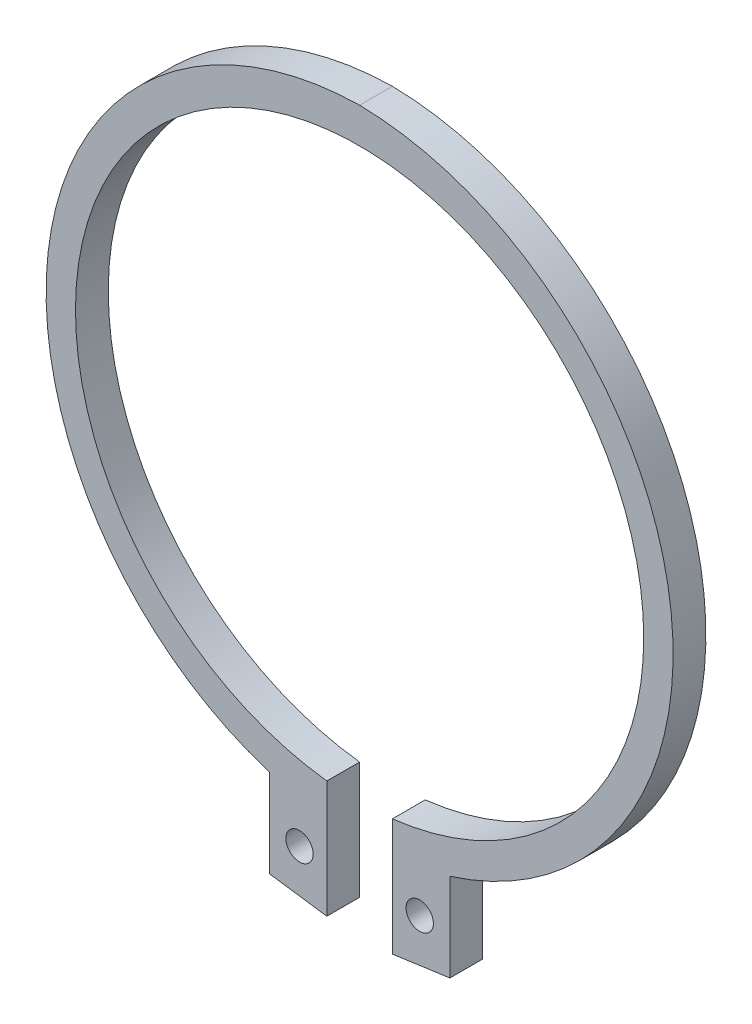
ISO-10303-21;
HEADER;
FILE_DESCRIPTION(('STEP AP214'),'2;1');
FILE_NAME('part.step','',(''),(''),'','','');
FILE_SCHEMA(('AUTOMOTIVE_DESIGN { 1 0 10303 214 1 1 1 1 }'));
ENDSEC;
DATA;
#1=APPLICATION_CONTEXT('core data for automotive mechanical design processes');
#2=APPLICATION_PROTOCOL_DEFINITION('international standard','automotive_design',2000,#1);
#3=PRODUCT_CONTEXT('',#1,'mechanical');
#4=PRODUCT('Part','Part','',(#3));
#5=PRODUCT_RELATED_PRODUCT_CATEGORY('part','',(#4));
#6=PRODUCT_DEFINITION_FORMATION('','',#4);
#7=PRODUCT_DEFINITION_CONTEXT('part definition',#1,'design');
#8=PRODUCT_DEFINITION('design','',#6,#7);
#9=PRODUCT_DEFINITION_SHAPE('','',#8);
#10=(LENGTH_UNIT() NAMED_UNIT(*) SI_UNIT(.MILLI.,.METRE.));
#11=(NAMED_UNIT(*) PLANE_ANGLE_UNIT() SI_UNIT($,.RADIAN.));
#12=(NAMED_UNIT(*) SI_UNIT($,.STERADIAN.) SOLID_ANGLE_UNIT());
#13=UNCERTAINTY_MEASURE_WITH_UNIT(LENGTH_MEASURE(1.E-05),#10,'distance_accuracy_value','');
#14=(GEOMETRIC_REPRESENTATION_CONTEXT(3) GLOBAL_UNCERTAINTY_ASSIGNED_CONTEXT((#13)) GLOBAL_UNIT_ASSIGNED_CONTEXT((#10,
#11,#12)) REPRESENTATION_CONTEXT('',''));
#15=CARTESIAN_POINT('',(0.,0.,0.));
#16=DIRECTION('',(0.,0.,1.));
#17=DIRECTION('',(1.,0.,0.));
#18=AXIS2_PLACEMENT_3D('',#15,#16,#17);
#19=CARTESIAN_POINT('',(5.5,-32.25,1.5));
#20=DIRECTION('',(0.,0.,-1.));
#21=DIRECTION('',(1.,0.,0.));
#22=AXIS2_PLACEMENT_3D('',#19,#20,#21);
#23=CYLINDRICAL_SURFACE('',#22,1.25);
#24=CARTESIAN_POINT('',(5.5,-32.25,0.));
#25=DIRECTION('',(0.,0.,1.));
#26=DIRECTION('',(1.,0.,0.));
#27=AXIS2_PLACEMENT_3D('',#24,#25,#26);
#28=CIRCLE('',#27,1.25);
#29=CARTESIAN_POINT('',(6.75,-32.25,0.));
#30=VERTEX_POINT('',#29);
#31=EDGE_CURVE('E32',#30,#30,#28,.T.);
#32=ORIENTED_EDGE('',*,*,#31,.F.);
#33=EDGE_LOOP('',(#32));
#34=FACE_BOUND('',#33,.T.);
#35=CARTESIAN_POINT('',(5.5,-32.25,3.));
#36=DIRECTION('',(0.,0.,-1.));
#37=DIRECTION('',(1.,0.,0.));
#38=AXIS2_PLACEMENT_3D('',#35,#36,#37);
#39=CIRCLE('',#38,1.25);
#40=CARTESIAN_POINT('',(6.75,-32.25,3.));
#41=VERTEX_POINT('',#40);
#42=EDGE_CURVE('E102',#41,#41,#39,.T.);
#43=ORIENTED_EDGE('',*,*,#42,.F.);
#44=EDGE_LOOP('',(#43));
#45=FACE_BOUND('',#44,.T.);
#46=ADVANCED_FACE('F16',(#34,#45),#23,.F.);
#47=CARTESIAN_POINT('',(-5.5,-32.25,1.5));
#48=DIRECTION('',(0.,0.,-1.));
#49=DIRECTION('',(1.,0.,0.));
#50=AXIS2_PLACEMENT_3D('',#47,#48,#49);
#51=CYLINDRICAL_SURFACE('',#50,1.25);
#52=CARTESIAN_POINT('',(-5.5,-32.25,0.));
#53=DIRECTION('',(0.,0.,1.));
#54=DIRECTION('',(1.,0.,0.));
#55=AXIS2_PLACEMENT_3D('',#52,#53,#54);
#56=CIRCLE('',#55,1.25);
#57=CARTESIAN_POINT('',(-4.25,-32.25,0.));
#58=VERTEX_POINT('',#57);
#59=EDGE_CURVE('E116',#58,#58,#56,.T.);
#60=ORIENTED_EDGE('',*,*,#59,.F.);
#61=EDGE_LOOP('',(#60));
#62=FACE_BOUND('',#61,.T.);
#63=CARTESIAN_POINT('',(-5.5,-32.25,3.));
#64=DIRECTION('',(0.,0.,-1.));
#65=DIRECTION('',(1.,0.,0.));
#66=AXIS2_PLACEMENT_3D('',#63,#64,#65);
#67=CIRCLE('',#66,1.25);
#68=CARTESIAN_POINT('',(-4.25,-32.25,3.));
#69=VERTEX_POINT('',#68);
#70=EDGE_CURVE('E113',#69,#69,#67,.T.);
#71=ORIENTED_EDGE('',*,*,#70,.F.);
#72=EDGE_LOOP('',(#71));
#73=FACE_BOUND('',#72,.T.);
#74=ADVANCED_FACE('F176',(#62,#73),#51,.F.);
#75=CARTESIAN_POINT('',(3.,-21.375,1.5));
#76=DIRECTION('',(-1.,0.,0.));
#77=DIRECTION('',(0.,0.,1.));
#78=AXIS2_PLACEMENT_3D('',#75,#76,#77);
#79=PLANE('',#78);
#80=DIRECTION('',(0.,0.,-1.));
#81=VECTOR('',#80,1.);
#82=CARTESIAN_POINT('',(3.,-36.5479621922823,2.25));
#83=LINE('',#82,#81);
#84=CARTESIAN_POINT('',(3.,-36.5479621922823,3.));
#85=VERTEX_POINT('',#84);
#86=CARTESIAN_POINT('',(3.,-36.5479621922823,0.));
#87=VERTEX_POINT('',#86);
#88=EDGE_CURVE('E11',#85,#87,#83,.T.);
#89=ORIENTED_EDGE('',*,*,#88,.F.);
#90=DIRECTION('',(0.,-1.,0.));
#91=VECTOR('',#90,1.);
#92=CARTESIAN_POINT('',(3.,-11.8490318690869,3.));
#93=LINE('',#92,#91);
#94=CARTESIAN_POINT('',(3.,-25.8263431402899,3.));
#95=VERTEX_POINT('',#94);
#96=EDGE_CURVE('E110',#95,#85,#93,.T.);
#97=ORIENTED_EDGE('',*,*,#96,.F.);
#98=DIRECTION('',(0.,0.,1.));
#99=VECTOR('',#98,1.);
#100=CARTESIAN_POINT('',(3.,-25.8263431402899,1.5));
#101=LINE('',#100,#99);
#102=CARTESIAN_POINT('',(3.,-25.8263431402899,0.));
#103=VERTEX_POINT('',#102);
#104=EDGE_CURVE('E119',#103,#95,#101,.T.);
#105=ORIENTED_EDGE('',*,*,#104,.F.);
#106=DIRECTION('',(0.,1.,0.));
#107=VECTOR('',#106,1.);
#108=CARTESIAN_POINT('',(3.,-11.8490318690869,0.));
#109=LINE('',#108,#107);
#110=EDGE_CURVE('E79',#87,#103,#109,.T.);
#111=ORIENTED_EDGE('',*,*,#110,.F.);
#112=EDGE_LOOP('',(#89,#97,#105,#111));
#113=FACE_BOUND('',#112,.T.);
#114=ADVANCED_FACE('F208',(#113),#79,.T.);
#115=CARTESIAN_POINT('',(-3.,-21.375,1.5));
#116=DIRECTION('',(1.,0.,0.));
#117=DIRECTION('',(0.,0.,-1.));
#118=AXIS2_PLACEMENT_3D('',#115,#116,#117);
#119=PLANE('',#118);
#120=DIRECTION('',(0.,0.,1.));
#121=VECTOR('',#120,1.);
#122=CARTESIAN_POINT('',(-3.,-36.5479621922823,0.75));
#123=LINE('',#122,#121);
#124=CARTESIAN_POINT('',(-3.,-36.5479621922823,0.));
#125=VERTEX_POINT('',#124);
#126=CARTESIAN_POINT('',(-3.,-36.5479621922823,3.));
#127=VERTEX_POINT('',#126);
#128=EDGE_CURVE('E55',#125,#127,#123,.T.);
#129=ORIENTED_EDGE('',*,*,#128,.F.);
#130=DIRECTION('',(0.,-1.,0.));
#131=VECTOR('',#130,1.);
#132=CARTESIAN_POINT('',(-3.,-11.8490318690869,0.));
#133=LINE('',#132,#131);
#134=CARTESIAN_POINT('',(-3.,-25.8263431402899,0.));
#135=VERTEX_POINT('',#134);
#136=EDGE_CURVE('E59',#135,#125,#133,.T.);
#137=ORIENTED_EDGE('',*,*,#136,.F.);
#138=DIRECTION('',(0.,0.,-1.));
#139=VECTOR('',#138,1.);
#140=CARTESIAN_POINT('',(-3.,-25.8263431402899,1.5));
#141=LINE('',#140,#139);
#142=CARTESIAN_POINT('',(-3.,-25.8263431402899,3.));
#143=VERTEX_POINT('',#142);
#144=EDGE_CURVE('E109',#143,#135,#141,.T.);
#145=ORIENTED_EDGE('',*,*,#144,.F.);
#146=DIRECTION('',(0.,1.,0.));
#147=VECTOR('',#146,1.);
#148=CARTESIAN_POINT('',(-3.,-11.8490318690869,3.));
#149=LINE('',#148,#147);
#150=EDGE_CURVE('E63',#127,#143,#149,.T.);
#151=ORIENTED_EDGE('',*,*,#150,.F.);
#152=EDGE_LOOP('',(#129,#137,#145,#151));
#153=FACE_BOUND('',#152,.T.);
#154=ADVANCED_FACE('F57',(#153),#119,.T.);
#155=CARTESIAN_POINT('',(5.26650027928807,-36.2295810156214,3.));
#156=DIRECTION('',(0.139106833678077,-0.990277379739667,0.));
#157=DIRECTION('',(-0.990277379739667,-0.139106833678077,0.));
#158=AXIS2_PLACEMENT_3D('',#155,#156,#157);
#159=PLANE('',#158);
#160=ORIENTED_EDGE('',*,*,#88,.T.);
#161=DIRECTION('',(0.990277379739667,0.139106833678077,0.));
#162=VECTOR('',#161,1.);
#163=CARTESIAN_POINT('',(8.26695124713703,-35.8080998808574,0.));
#164=LINE('',#163,#162);
#165=CARTESIAN_POINT('',(8.26695124713703,-35.8080998808574,0.));
#166=VERTEX_POINT('',#165);
#167=EDGE_CURVE('E20',#87,#166,#164,.T.);
#168=ORIENTED_EDGE('',*,*,#167,.T.);
#169=DIRECTION('',(0.,0.,-1.));
#170=VECTOR('',#169,1.);
#171=CARTESIAN_POINT('',(8.26695124713703,-35.8080998808574,3.));
#172=LINE('',#171,#170);
#173=CARTESIAN_POINT('',(8.26695124713703,-35.8080998808574,3.));
#174=VERTEX_POINT('',#173);
#175=EDGE_CURVE('E95',#174,#166,#172,.T.);
#176=ORIENTED_EDGE('',*,*,#175,.F.);
#177=DIRECTION('',(-0.990277379739667,-0.139106833678077,0.));
#178=VECTOR('',#177,1.);
#179=CARTESIAN_POINT('',(8.26695124713703,-35.8080998808574,3.));
#180=LINE('',#179,#178);
#181=EDGE_CURVE('E115',#174,#85,#180,.T.);
#182=ORIENTED_EDGE('',*,*,#181,.T.);
#183=EDGE_LOOP('',(#160,#168,#176,#182));
#184=FACE_BOUND('',#183,.T.);
#185=ADVANCED_FACE('F205',(#184),#159,.T.);
#186=CARTESIAN_POINT('',(-14.9876790173679,-2.32306373817371,0.));
#187=DIRECTION('',(0.,0.,1.));
#188=DIRECTION('',(1.,0.,0.));
#189=AXIS2_PLACEMENT_3D('',#186,#187,#188);
#190=PLANE('',#189);
#191=ORIENTED_EDGE('',*,*,#31,.T.);
#192=EDGE_LOOP('',(#191));
#193=FACE_BOUND('',#192,.T.);
#194=ORIENTED_EDGE('',*,*,#59,.T.);
#195=EDGE_LOOP('',(#194));
#196=FACE_BOUND('',#195,.T.);
#197=ORIENTED_EDGE('',*,*,#110,.T.);
#198=CARTESIAN_POINT('',(0.,0.,0.));
#199=DIRECTION('',(0.,0.,-1.));
#200=DIRECTION('',(-1.,0.,0.));
#201=AXIS2_PLACEMENT_3D('',#198,#199,#200);
#202=CIRCLE('',#201,26.);
#203=EDGE_CURVE('E68',#135,#103,#202,.T.);
#204=ORIENTED_EDGE('',*,*,#203,.F.);
#205=ORIENTED_EDGE('',*,*,#136,.T.);
#206=DIRECTION('',(0.990277379739667,-0.139106833678077,0.));
#207=VECTOR('',#206,1.);
#208=CARTESIAN_POINT('',(-8.26695124713703,-35.8080998808574,0.));
#209=LINE('',#208,#207);
#210=CARTESIAN_POINT('',(-8.26695124713703,-35.8080998808574,0.));
#211=VERTEX_POINT('',#210);
#212=EDGE_CURVE('E76',#211,#125,#209,.T.);
#213=ORIENTED_EDGE('',*,*,#212,.F.);
#214=DIRECTION('',(0.,1.,0.));
#215=VECTOR('',#214,1.);
#216=CARTESIAN_POINT('',(-8.26695124713703,-35.8080998808574,0.));
#217=LINE('',#216,#215);
#218=CARTESIAN_POINT('',(-8.26695124713703,-27.7455998808574,0.));
#219=VERTEX_POINT('',#218);
#220=EDGE_CURVE('E80',#211,#219,#217,.T.);
#221=ORIENTED_EDGE('',*,*,#220,.T.);
#222=CARTESIAN_POINT('',(0.469411108907729,0.0717794076376238,0.));
#223=DIRECTION('',(0.,0.,1.));
#224=DIRECTION('',(1.,0.,0.));
#225=AXIS2_PLACEMENT_3D('',#222,#223,#224);
#226=CIRCLE('',#225,29.156999463184);
#227=CARTESIAN_POINT('',(0.,29.225,0.));
#228=VERTEX_POINT('',#227);
#229=EDGE_CURVE('E96',#228,#219,#226,.T.);
#230=ORIENTED_EDGE('',*,*,#229,.F.);
#231=CARTESIAN_POINT('',(-0.469411108907728,0.0717794076376238,0.));
#232=DIRECTION('',(0.,0.,1.));
#233=DIRECTION('',(-1.,0.,0.));
#234=AXIS2_PLACEMENT_3D('',#231,#232,#233);
#235=CIRCLE('',#234,29.156999463184);
#236=CARTESIAN_POINT('',(8.26695124713703,-27.7455998808574,0.));
#237=VERTEX_POINT('',#236);
#238=EDGE_CURVE('E125',#237,#228,#235,.T.);
#239=ORIENTED_EDGE('',*,*,#238,.F.);
#240=DIRECTION('',(0.,1.,0.));
#241=VECTOR('',#240,1.);
#242=CARTESIAN_POINT('',(8.26695124713703,-35.8080998808574,0.));
#243=LINE('',#242,#241);
#244=EDGE_CURVE('E107',#166,#237,#243,.T.);
#245=ORIENTED_EDGE('',*,*,#244,.F.);
#246=ORIENTED_EDGE('',*,*,#167,.F.);
#247=EDGE_LOOP('',(#197,#204,#205,#213,#221,#230,#239,#245,#246));
#248=FACE_BOUND('',#247,.T.);
#249=ADVANCED_FACE('F74',(#193,#196,#248),#190,.F.);
#250=CARTESIAN_POINT('',(-0.469411108907729,0.0717794076376238,3.));
#251=DIRECTION('',(0.,0.,1.));
#252=DIRECTION('',(-1.,0.,0.));
#253=AXIS2_PLACEMENT_3D('',#250,#251,#252);
#254=CYLINDRICAL_SURFACE('',#253,29.156999463184);
#255=ORIENTED_EDGE('',*,*,#238,.T.);
#256=DIRECTION('',(0.,0.,1.));
#257=VECTOR('',#256,1.);
#258=CARTESIAN_POINT('',(0.,29.225,0.));
#259=LINE('',#258,#257);
#260=CARTESIAN_POINT('',(0.,29.225,3.));
#261=VERTEX_POINT('',#260);
#262=EDGE_CURVE('E122',#228,#261,#259,.T.);
#263=ORIENTED_EDGE('',*,*,#262,.T.);
#264=CARTESIAN_POINT('',(-0.469411108907729,0.0717794076376238,3.));
#265=DIRECTION('',(0.,0.,-1.));
#266=DIRECTION('',(-1.,0.,0.));
#267=AXIS2_PLACEMENT_3D('',#264,#265,#266);
#268=CIRCLE('',#267,29.156999463184);
#269=CARTESIAN_POINT('',(8.26695124713703,-27.7455998808574,3.));
#270=VERTEX_POINT('',#269);
#271=EDGE_CURVE('E106',#261,#270,#268,.T.);
#272=ORIENTED_EDGE('',*,*,#271,.T.);
#273=DIRECTION('',(0.,0.,-1.));
#274=VECTOR('',#273,1.);
#275=CARTESIAN_POINT('',(8.26695124713703,-27.7455998808574,3.));
#276=LINE('',#275,#274);
#277=EDGE_CURVE('E103',#270,#237,#276,.T.);
#278=ORIENTED_EDGE('',*,*,#277,.T.);
#279=EDGE_LOOP('',(#255,#263,#272,#278));
#280=FACE_BOUND('',#279,.T.);
#281=ADVANCED_FACE('F202',(#280),#254,.T.);
#282=CARTESIAN_POINT('',(8.26695124713703,-31.7768498808574,3.));
#283=DIRECTION('',(1.,0.,0.));
#284=DIRECTION('',(0.,-1.,0.));
#285=AXIS2_PLACEMENT_3D('',#282,#283,#284);
#286=PLANE('',#285);
#287=ORIENTED_EDGE('',*,*,#244,.T.);
#288=ORIENTED_EDGE('',*,*,#277,.F.);
#289=DIRECTION('',(0.,1.,0.));
#290=VECTOR('',#289,1.);
#291=CARTESIAN_POINT('',(8.26695124713703,-35.8080998808574,3.));
#292=LINE('',#291,#290);
#293=EDGE_CURVE('E99',#174,#270,#292,.T.);
#294=ORIENTED_EDGE('',*,*,#293,.F.);
#295=ORIENTED_EDGE('',*,*,#175,.T.);
#296=EDGE_LOOP('',(#287,#288,#294,#295));
#297=FACE_BOUND('',#296,.T.);
#298=ADVANCED_FACE('F197',(#297),#286,.T.);
#299=CARTESIAN_POINT('',(0.469411108907729,0.0717794076376238,0.));
#300=DIRECTION('',(0.,0.,-1.));
#301=DIRECTION('',(1.,0.,0.));
#302=AXIS2_PLACEMENT_3D('',#299,#300,#301);
#303=CYLINDRICAL_SURFACE('',#302,29.156999463184);
#304=CARTESIAN_POINT('',(0.469411108907729,0.0717794076376238,3.));
#305=DIRECTION('',(0.,0.,-1.));
#306=DIRECTION('',(1.,0.,0.));
#307=AXIS2_PLACEMENT_3D('',#304,#305,#306);
#308=CIRCLE('',#307,29.156999463184);
#309=CARTESIAN_POINT('',(-8.26695124713703,-27.7455998808574,3.));
#310=VERTEX_POINT('',#309);
#311=EDGE_CURVE('E93',#310,#261,#308,.T.);
#312=ORIENTED_EDGE('',*,*,#311,.T.);
#313=ORIENTED_EDGE('',*,*,#262,.F.);
#314=ORIENTED_EDGE('',*,*,#229,.T.);
#315=DIRECTION('',(0.,0.,1.));
#316=VECTOR('',#315,1.);
#317=CARTESIAN_POINT('',(-8.26695124713703,-27.7455998808574,0.));
#318=LINE('',#317,#316);
#319=EDGE_CURVE('E118',#219,#310,#318,.T.);
#320=ORIENTED_EDGE('',*,*,#319,.T.);
#321=EDGE_LOOP('',(#312,#313,#314,#320));
#322=FACE_BOUND('',#321,.T.);
#323=ADVANCED_FACE('F133',(#322),#303,.T.);
#324=CARTESIAN_POINT('',(0.,0.,0.));
#325=DIRECTION('',(0.,0.,-1.));
#326=DIRECTION('',(1.,0.,0.));
#327=AXIS2_PLACEMENT_3D('',#324,#325,#326);
#328=CYLINDRICAL_SURFACE('',#327,26.);
#329=ORIENTED_EDGE('',*,*,#104,.T.);
#330=CARTESIAN_POINT('',(0.,0.,3.));
#331=DIRECTION('',(0.,0.,-1.));
#332=DIRECTION('',(-1.,0.,0.));
#333=AXIS2_PLACEMENT_3D('',#330,#331,#332);
#334=CIRCLE('',#333,26.);
#335=EDGE_CURVE('E100',#143,#95,#334,.T.);
#336=ORIENTED_EDGE('',*,*,#335,.F.);
#337=ORIENTED_EDGE('',*,*,#144,.T.);
#338=ORIENTED_EDGE('',*,*,#203,.T.);
#339=EDGE_LOOP('',(#329,#336,#337,#338));
#340=FACE_BOUND('',#339,.T.);
#341=ADVANCED_FACE('F212',(#340),#328,.F.);
#342=CARTESIAN_POINT('',(-5.26650027928807,-36.2295810156214,0.));
#343=DIRECTION('',(-0.139106833678077,-0.990277379739667,0.));
#344=DIRECTION('',(0.990277379739667,-0.139106833678077,0.));
#345=AXIS2_PLACEMENT_3D('',#342,#343,#344);
#346=PLANE('',#345);
#347=ORIENTED_EDGE('',*,*,#128,.T.);
#348=DIRECTION('',(-0.990277379739667,0.139106833678077,0.));
#349=VECTOR('',#348,1.);
#350=CARTESIAN_POINT('',(-8.26695124713703,-35.8080998808574,3.));
#351=LINE('',#350,#349);
#352=CARTESIAN_POINT('',(-8.26695124713703,-35.8080998808574,3.));
#353=VERTEX_POINT('',#352);
#354=EDGE_CURVE('E69',#127,#353,#351,.T.);
#355=ORIENTED_EDGE('',*,*,#354,.T.);
#356=DIRECTION('',(0.,0.,1.));
#357=VECTOR('',#356,1.);
#358=CARTESIAN_POINT('',(-8.26695124713703,-35.8080998808574,0.));
#359=LINE('',#358,#357);
#360=EDGE_CURVE('E85',#211,#353,#359,.T.);
#361=ORIENTED_EDGE('',*,*,#360,.F.);
#362=ORIENTED_EDGE('',*,*,#212,.T.);
#363=EDGE_LOOP('',(#347,#355,#361,#362));
#364=FACE_BOUND('',#363,.T.);
#365=ADVANCED_FACE('F83',(#364),#346,.T.);
#366=CARTESIAN_POINT('',(-8.26695124713703,-31.7768498808574,0.));
#367=DIRECTION('',(-1.,0.,0.));
#368=DIRECTION('',(0.,-1.,0.));
#369=AXIS2_PLACEMENT_3D('',#366,#367,#368);
#370=PLANE('',#369);
#371=DIRECTION('',(0.,1.,0.));
#372=VECTOR('',#371,1.);
#373=CARTESIAN_POINT('',(-8.26695124713703,-35.8080998808574,3.));
#374=LINE('',#373,#372);
#375=EDGE_CURVE('E86',#353,#310,#374,.T.);
#376=ORIENTED_EDGE('',*,*,#375,.T.);
#377=ORIENTED_EDGE('',*,*,#319,.F.);
#378=ORIENTED_EDGE('',*,*,#220,.F.);
#379=ORIENTED_EDGE('',*,*,#360,.T.);
#380=EDGE_LOOP('',(#376,#377,#378,#379));
#381=FACE_BOUND('',#380,.T.);
#382=ADVANCED_FACE('F18',(#381),#370,.T.);
#383=CARTESIAN_POINT('',(-14.9876790173679,-2.32306373817371,3.));
#384=DIRECTION('',(0.,0.,1.));
#385=DIRECTION('',(1.,0.,0.));
#386=AXIS2_PLACEMENT_3D('',#383,#384,#385);
#387=PLANE('',#386);
#388=ORIENTED_EDGE('',*,*,#42,.T.);
#389=EDGE_LOOP('',(#388));
#390=FACE_BOUND('',#389,.T.);
#391=ORIENTED_EDGE('',*,*,#70,.T.);
#392=EDGE_LOOP('',(#391));
#393=FACE_BOUND('',#392,.T.);
#394=ORIENTED_EDGE('',*,*,#96,.T.);
#395=ORIENTED_EDGE('',*,*,#181,.F.);
#396=ORIENTED_EDGE('',*,*,#293,.T.);
#397=ORIENTED_EDGE('',*,*,#271,.F.);
#398=ORIENTED_EDGE('',*,*,#311,.F.);
#399=ORIENTED_EDGE('',*,*,#375,.F.);
#400=ORIENTED_EDGE('',*,*,#354,.F.);
#401=ORIENTED_EDGE('',*,*,#150,.T.);
#402=ORIENTED_EDGE('',*,*,#335,.T.);
#403=EDGE_LOOP('',(#394,#395,#396,#397,#398,#399,#400,#401,#402));
#404=FACE_BOUND('',#403,.T.);
#405=ADVANCED_FACE('F144',(#390,#393,#404),#387,.T.);
#406=CLOSED_SHELL('',(#46,#74,#114,#154,#185,#249,#281,#298,#323,#341,#365,#382,#405));
#407=MANIFOLD_SOLID_BREP('B1',#406);
#408=ADVANCED_BREP_SHAPE_REPRESENTATION('',(#18,#407),#14);
#409=SHAPE_DEFINITION_REPRESENTATION(#9,#408);
ENDSEC;
END-ISO-10303-21;
